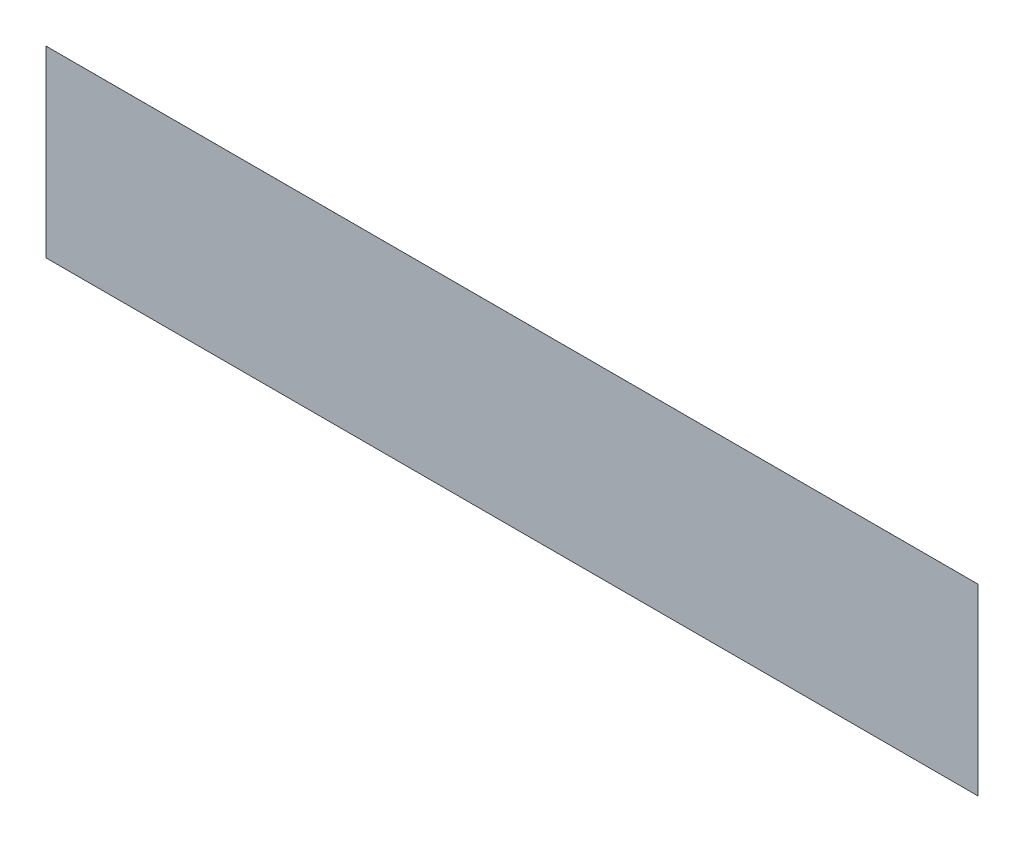
ISO-10303-21;
HEADER;
FILE_DESCRIPTION(('STEP AP214'),'2;1');
FILE_NAME('part.step','',(''),(''),'','','');
FILE_SCHEMA(('AUTOMOTIVE_DESIGN { 1 0 10303 214 1 1 1 1 }'));
ENDSEC;
DATA;
#1=APPLICATION_CONTEXT('core data for automotive mechanical design processes');
#2=APPLICATION_PROTOCOL_DEFINITION('international standard','automotive_design',2000,#1);
#3=PRODUCT_CONTEXT('',#1,'mechanical');
#4=PRODUCT('Part','Part','',(#3));
#5=PRODUCT_RELATED_PRODUCT_CATEGORY('part','',(#4));
#6=PRODUCT_DEFINITION_FORMATION('','',#4);
#7=PRODUCT_DEFINITION_CONTEXT('part definition',#1,'design');
#8=PRODUCT_DEFINITION('design','',#6,#7);
#9=PRODUCT_DEFINITION_SHAPE('','',#8);
#10=(LENGTH_UNIT() NAMED_UNIT(*) SI_UNIT(.MILLI.,.METRE.));
#11=(NAMED_UNIT(*) PLANE_ANGLE_UNIT() SI_UNIT($,.RADIAN.));
#12=(NAMED_UNIT(*) SI_UNIT($,.STERADIAN.) SOLID_ANGLE_UNIT());
#13=UNCERTAINTY_MEASURE_WITH_UNIT(LENGTH_MEASURE(1.E-05),#10,'distance_accuracy_value','');
#14=(GEOMETRIC_REPRESENTATION_CONTEXT(3) GLOBAL_UNCERTAINTY_ASSIGNED_CONTEXT((#13)) GLOBAL_UNIT_ASSIGNED_CONTEXT((#10,
#11,#12)) REPRESENTATION_CONTEXT('',''));
#15=CARTESIAN_POINT('',(0.,0.,0.));
#16=DIRECTION('',(0.,0.,1.));
#17=DIRECTION('',(1.,0.,0.));
#18=AXIS2_PLACEMENT_3D('',#15,#16,#17);
#19=CARTESIAN_POINT('',(-2992.14252543929,2681.64917609875,0.1));
#20=DIRECTION('',(1.,0.,0.));
#21=DIRECTION('',(0.,1.,0.));
#22=AXIS2_PLACEMENT_3D('',#19,#20,#21);
#23=PLANE('',#22);
#24=DIRECTION('',(0.,-1.,0.));
#25=VECTOR('',#24,1.);
#26=CARTESIAN_POINT('',(-2992.14252543929,2681.64917609875,0.));
#27=LINE('',#26,#25);
#28=CARTESIAN_POINT('',(-2992.14252543929,2681.64917609875,0.));
#29=VERTEX_POINT('',#28);
#30=CARTESIAN_POINT('',(-2992.14252543929,1481.64917609875,0.));
#31=VERTEX_POINT('',#30);
#32=EDGE_CURVE('E101',#29,#31,#27,.T.);
#33=ORIENTED_EDGE('',*,*,#32,.T.);
#34=DIRECTION('',(0.,0.,-1.));
#35=VECTOR('',#34,1.);
#36=CARTESIAN_POINT('',(-2992.14252543929,1481.64917609875,0.1));
#37=LINE('',#36,#35);
#38=CARTESIAN_POINT('',(-2992.14252543929,1481.64917609875,0.1));
#39=VERTEX_POINT('',#38);
#40=EDGE_CURVE('E11',#39,#31,#37,.T.);
#41=ORIENTED_EDGE('',*,*,#40,.F.);
#42=DIRECTION('',(0.,-1.,0.));
#43=VECTOR('',#42,1.);
#44=CARTESIAN_POINT('',(-2992.14252543929,2681.64917609875,0.1));
#45=LINE('',#44,#43);
#46=CARTESIAN_POINT('',(-2992.14252543929,2681.64917609875,0.1));
#47=VERTEX_POINT('',#46);
#48=EDGE_CURVE('E89',#47,#39,#45,.T.);
#49=ORIENTED_EDGE('',*,*,#48,.F.);
#50=DIRECTION('',(0.,0.,-1.));
#51=VECTOR('',#50,1.);
#52=CARTESIAN_POINT('',(-2992.14252543929,2681.64917609875,0.1));
#53=LINE('',#52,#51);
#54=EDGE_CURVE('E97',#47,#29,#53,.T.);
#55=ORIENTED_EDGE('',*,*,#54,.T.);
#56=EDGE_LOOP('',(#33,#41,#49,#55));
#57=FACE_BOUND('',#56,.T.);
#58=ADVANCED_FACE('F38',(#57),#23,.F.);
#59=CARTESIAN_POINT('',(-2992.14252543929,1481.64917609875,0.1));
#60=DIRECTION('',(0.,1.,0.));
#61=DIRECTION('',(0.,0.,1.));
#62=AXIS2_PLACEMENT_3D('',#59,#60,#61);
#63=PLANE('',#62);
#64=DIRECTION('',(1.,0.,0.));
#65=VECTOR('',#64,1.);
#66=CARTESIAN_POINT('',(-2992.14252543929,1481.64917609875,0.));
#67=LINE('',#66,#65);
#68=CARTESIAN_POINT('',(3103.85747456071,1481.64917609875,0.));
#69=VERTEX_POINT('',#68);
#70=EDGE_CURVE('E93',#31,#69,#67,.T.);
#71=ORIENTED_EDGE('',*,*,#70,.T.);
#72=DIRECTION('',(0.,0.,-1.));
#73=VECTOR('',#72,1.);
#74=CARTESIAN_POINT('',(3103.85747456071,1481.64917609875,0.1));
#75=LINE('',#74,#73);
#76=CARTESIAN_POINT('',(3103.85747456071,1481.64917609875,0.1));
#77=VERTEX_POINT('',#76);
#78=EDGE_CURVE('E46',#77,#69,#75,.T.);
#79=ORIENTED_EDGE('',*,*,#78,.F.);
#80=DIRECTION('',(1.,0.,0.));
#81=VECTOR('',#80,1.);
#82=CARTESIAN_POINT('',(-2992.14252543929,1481.64917609875,0.1));
#83=LINE('',#82,#81);
#84=EDGE_CURVE('E84',#39,#77,#83,.T.);
#85=ORIENTED_EDGE('',*,*,#84,.F.);
#86=ORIENTED_EDGE('',*,*,#40,.T.);
#87=EDGE_LOOP('',(#71,#79,#85,#86));
#88=FACE_BOUND('',#87,.T.);
#89=ADVANCED_FACE('F92',(#88),#63,.F.);
#90=CARTESIAN_POINT('',(3103.85747456071,2681.64917609875,0.1));
#91=DIRECTION('',(-1.,0.,0.));
#92=DIRECTION('',(0.,-1.,0.));
#93=AXIS2_PLACEMENT_3D('',#90,#91,#92);
#94=PLANE('',#93);
#95=DIRECTION('',(0.,1.,0.));
#96=VECTOR('',#95,1.);
#97=CARTESIAN_POINT('',(3103.85747456071,2681.64917609875,0.));
#98=LINE('',#97,#96);
#99=CARTESIAN_POINT('',(3103.85747456071,2681.64917609875,0.));
#100=VERTEX_POINT('',#99);
#101=EDGE_CURVE('E71',#69,#100,#98,.T.);
#102=ORIENTED_EDGE('',*,*,#101,.T.);
#103=DIRECTION('',(0.,0.,-1.));
#104=VECTOR('',#103,1.);
#105=CARTESIAN_POINT('',(3103.85747456071,2681.64917609875,0.1));
#106=LINE('',#105,#104);
#107=CARTESIAN_POINT('',(3103.85747456071,2681.64917609875,0.1));
#108=VERTEX_POINT('',#107);
#109=EDGE_CURVE('E94',#108,#100,#106,.T.);
#110=ORIENTED_EDGE('',*,*,#109,.F.);
#111=DIRECTION('',(0.,1.,0.));
#112=VECTOR('',#111,1.);
#113=CARTESIAN_POINT('',(3103.85747456071,2681.64917609875,0.1));
#114=LINE('',#113,#112);
#115=EDGE_CURVE('E87',#77,#108,#114,.T.);
#116=ORIENTED_EDGE('',*,*,#115,.F.);
#117=ORIENTED_EDGE('',*,*,#78,.T.);
#118=EDGE_LOOP('',(#102,#110,#116,#117));
#119=FACE_BOUND('',#118,.T.);
#120=ADVANCED_FACE('F95',(#119),#94,.F.);
#121=CARTESIAN_POINT('',(-2992.14252543929,2681.64917609875,0.1));
#122=DIRECTION('',(0.,-1.,0.));
#123=DIRECTION('',(0.,0.,-1.));
#124=AXIS2_PLACEMENT_3D('',#121,#122,#123);
#125=PLANE('',#124);
#126=DIRECTION('',(-1.,0.,0.));
#127=VECTOR('',#126,1.);
#128=CARTESIAN_POINT('',(-2992.14252543929,2681.64917609875,0.));
#129=LINE('',#128,#127);
#130=EDGE_CURVE('E77',#100,#29,#129,.T.);
#131=ORIENTED_EDGE('',*,*,#130,.T.);
#132=ORIENTED_EDGE('',*,*,#54,.F.);
#133=DIRECTION('',(-1.,0.,0.));
#134=VECTOR('',#133,1.);
#135=CARTESIAN_POINT('',(-2992.14252543929,2681.64917609875,0.1));
#136=LINE('',#135,#134);
#137=EDGE_CURVE('E54',#108,#47,#136,.T.);
#138=ORIENTED_EDGE('',*,*,#137,.F.);
#139=ORIENTED_EDGE('',*,*,#109,.T.);
#140=EDGE_LOOP('',(#131,#132,#138,#139));
#141=FACE_BOUND('',#140,.T.);
#142=ADVANCED_FACE('F108',(#141),#125,.F.);
#143=CARTESIAN_POINT('',(0.,0.,0.1));
#144=DIRECTION('',(0.,0.,1.));
#145=DIRECTION('',(1.,0.,0.));
#146=AXIS2_PLACEMENT_3D('',#143,#144,#145);
#147=PLANE('',#146);
#148=ORIENTED_EDGE('',*,*,#48,.T.);
#149=ORIENTED_EDGE('',*,*,#84,.T.);
#150=ORIENTED_EDGE('',*,*,#115,.T.);
#151=ORIENTED_EDGE('',*,*,#137,.T.);
#152=EDGE_LOOP('',(#148,#149,#150,#151));
#153=FACE_BOUND('',#152,.T.);
#154=ADVANCED_FACE('F85',(#153),#147,.T.);
#155=CARTESIAN_POINT('',(0.,0.,0.));
#156=DIRECTION('',(0.,0.,1.));
#157=DIRECTION('',(1.,0.,0.));
#158=AXIS2_PLACEMENT_3D('',#155,#156,#157);
#159=PLANE('',#158);
#160=ORIENTED_EDGE('',*,*,#32,.F.);
#161=ORIENTED_EDGE('',*,*,#130,.F.);
#162=ORIENTED_EDGE('',*,*,#101,.F.);
#163=ORIENTED_EDGE('',*,*,#70,.F.);
#164=EDGE_LOOP('',(#160,#161,#162,#163));
#165=FACE_BOUND('',#164,.T.);
#166=ADVANCED_FACE('F111',(#165),#159,.F.);
#167=CLOSED_SHELL('',(#58,#89,#120,#142,#154,#166));
#168=MANIFOLD_SOLID_BREP('B2',#167);
#169=ADVANCED_BREP_SHAPE_REPRESENTATION('',(#18,#168),#14);
#170=SHAPE_DEFINITION_REPRESENTATION(#9,#169);
ENDSEC;
END-ISO-10303-21;
